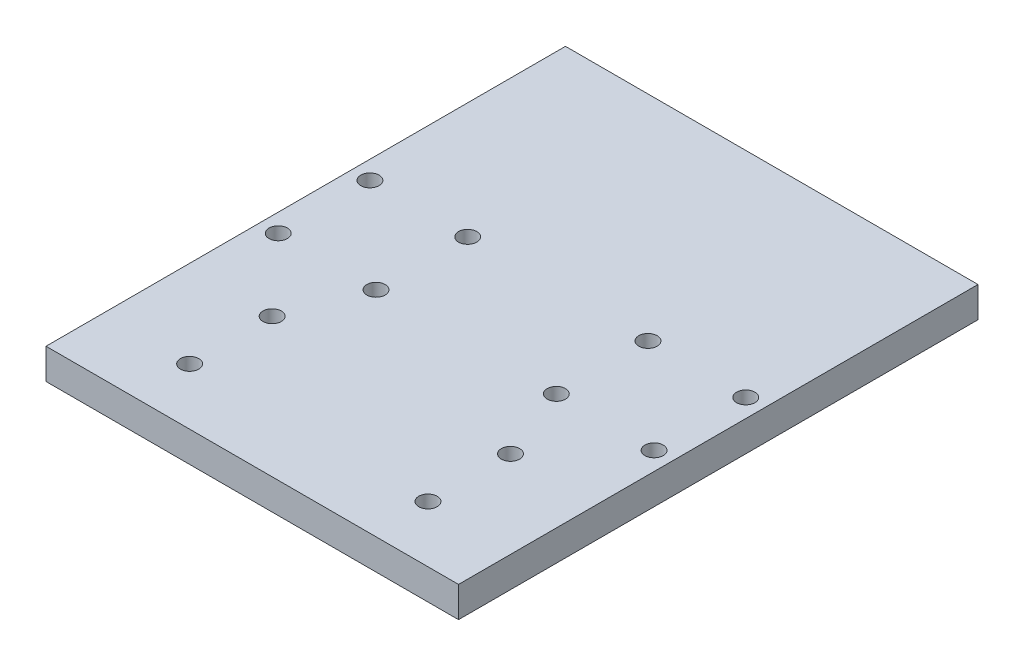
ISO-10303-21;
HEADER;
FILE_DESCRIPTION(('STEP AP214'),'2;1');
FILE_NAME('part.step','',(''),(''),'','','');
FILE_SCHEMA(('AUTOMOTIVE_DESIGN { 1 0 10303 214 1 1 1 1 }'));
ENDSEC;
DATA;
#1=APPLICATION_CONTEXT('core data for automotive mechanical design processes');
#2=APPLICATION_PROTOCOL_DEFINITION('international standard','automotive_design',2000,#1);
#3=PRODUCT_CONTEXT('',#1,'mechanical');
#4=PRODUCT('Part','Part','',(#3));
#5=PRODUCT_RELATED_PRODUCT_CATEGORY('part','',(#4));
#6=PRODUCT_DEFINITION_FORMATION('','',#4);
#7=PRODUCT_DEFINITION_CONTEXT('part definition',#1,'design');
#8=PRODUCT_DEFINITION('design','',#6,#7);
#9=PRODUCT_DEFINITION_SHAPE('','',#8);
#10=(LENGTH_UNIT() NAMED_UNIT(*) SI_UNIT(.MILLI.,.METRE.));
#11=(NAMED_UNIT(*) PLANE_ANGLE_UNIT() SI_UNIT($,.RADIAN.));
#12=(NAMED_UNIT(*) SI_UNIT($,.STERADIAN.) SOLID_ANGLE_UNIT());
#13=UNCERTAINTY_MEASURE_WITH_UNIT(LENGTH_MEASURE(1.E-05),#10,'distance_accuracy_value','');
#14=(GEOMETRIC_REPRESENTATION_CONTEXT(3) GLOBAL_UNCERTAINTY_ASSIGNED_CONTEXT((#13)) GLOBAL_UNIT_ASSIGNED_CONTEXT((#10,
#11,#12)) REPRESENTATION_CONTEXT('',''));
#15=CARTESIAN_POINT('',(0.,0.,0.));
#16=DIRECTION('',(0.,0.,1.));
#17=DIRECTION('',(1.,0.,0.));
#18=AXIS2_PLACEMENT_3D('',#15,#16,#17);
#19=CARTESIAN_POINT('',(0.,5.,0.));
#20=DIRECTION('',(0.,-1.,0.));
#21=DIRECTION('',(0.,0.,-1.));
#22=AXIS2_PLACEMENT_3D('',#19,#20,#21);
#23=PLANE('',#22);
#24=CARTESIAN_POINT('',(-19.5,5.,19.75));
#25=DIRECTION('',(0.,1.,0.));
#26=DIRECTION('',(0.,0.,1.));
#27=AXIS2_PLACEMENT_3D('',#24,#25,#26);
#28=CIRCLE('',#27,1.5);
#29=CARTESIAN_POINT('',(-19.5,5.,21.25));
#30=VERTEX_POINT('',#29);
#31=EDGE_CURVE('E445',#30,#30,#28,.T.);
#32=ORIENTED_EDGE('',*,*,#31,.F.);
#33=EDGE_LOOP('',(#32));
#34=FACE_BOUND('',#33,.T.);
#35=CARTESIAN_POINT('',(19.5,5.,33.2499999999999));
#36=DIRECTION('',(0.,1.,0.));
#37=DIRECTION('',(0.,0.,-1.));
#38=AXIS2_PLACEMENT_3D('',#35,#36,#37);
#39=CIRCLE('',#38,1.50000000000001);
#40=CARTESIAN_POINT('',(19.5,5.,31.7499999999999));
#41=VERTEX_POINT('',#40);
#42=EDGE_CURVE('E441',#41,#41,#39,.T.);
#43=ORIENTED_EDGE('',*,*,#42,.F.);
#44=EDGE_LOOP('',(#43));
#45=FACE_BOUND('',#44,.T.);
#46=CARTESIAN_POINT('',(19.5,5.,19.7499999999999));
#47=DIRECTION('',(0.,1.,0.));
#48=DIRECTION('',(0.,0.,-1.));
#49=AXIS2_PLACEMENT_3D('',#46,#47,#48);
#50=CIRCLE('',#49,1.50000000000001);
#51=CARTESIAN_POINT('',(19.5,5.,18.2499999999999));
#52=VERTEX_POINT('',#51);
#53=EDGE_CURVE('E438',#52,#52,#50,.T.);
#54=ORIENTED_EDGE('',*,*,#53,.F.);
#55=EDGE_LOOP('',(#54));
#56=FACE_BOUND('',#55,.T.);
#57=CARTESIAN_POINT('',(-19.5,5.,33.25));
#58=DIRECTION('',(0.,1.,0.));
#59=DIRECTION('',(0.,0.,1.));
#60=AXIS2_PLACEMENT_3D('',#57,#58,#59);
#61=CIRCLE('',#60,1.5);
#62=CARTESIAN_POINT('',(-19.5,5.,34.75));
#63=VERTEX_POINT('',#62);
#64=EDGE_CURVE('E114',#63,#63,#61,.T.);
#65=ORIENTED_EDGE('',*,*,#64,.F.);
#66=EDGE_LOOP('',(#65));
#67=FACE_BOUND('',#66,.T.);
#68=CARTESIAN_POINT('',(-14.75,5.,7.5));
#69=DIRECTION('',(0.,1.,0.));
#70=DIRECTION('',(0.,0.,1.));
#71=AXIS2_PLACEMENT_3D('',#68,#69,#70);
#72=CIRCLE('',#71,1.5);
#73=CARTESIAN_POINT('',(-14.75,5.,9.));
#74=VERTEX_POINT('',#73);
#75=EDGE_CURVE('E146',#74,#74,#72,.T.);
#76=ORIENTED_EDGE('',*,*,#75,.F.);
#77=EDGE_LOOP('',(#76));
#78=FACE_BOUND('',#77,.T.);
#79=CARTESIAN_POINT('',(-30.75,5.,7.5));
#80=DIRECTION('',(0.,1.,0.));
#81=DIRECTION('',(0.,0.,1.));
#82=AXIS2_PLACEMENT_3D('',#79,#80,#81);
#83=CIRCLE('',#82,1.5);
#84=CARTESIAN_POINT('',(-30.75,5.,9.));
#85=VERTEX_POINT('',#84);
#86=EDGE_CURVE('E150',#85,#85,#83,.T.);
#87=ORIENTED_EDGE('',*,*,#86,.F.);
#88=EDGE_LOOP('',(#87));
#89=FACE_BOUND('',#88,.T.);
#90=CARTESIAN_POINT('',(-14.75,5.,-7.5));
#91=DIRECTION('',(0.,1.,0.));
#92=DIRECTION('',(0.,0.,1.));
#93=AXIS2_PLACEMENT_3D('',#90,#91,#92);
#94=CIRCLE('',#93,1.5);
#95=CARTESIAN_POINT('',(-14.75,5.,-6.));
#96=VERTEX_POINT('',#95);
#97=EDGE_CURVE('E154',#96,#96,#94,.T.);
#98=ORIENTED_EDGE('',*,*,#97,.F.);
#99=EDGE_LOOP('',(#98));
#100=FACE_BOUND('',#99,.T.);
#101=CARTESIAN_POINT('',(-30.75,5.,-7.5));
#102=DIRECTION('',(0.,1.,0.));
#103=DIRECTION('',(0.,0.,1.));
#104=AXIS2_PLACEMENT_3D('',#101,#102,#103);
#105=CIRCLE('',#104,1.5);
#106=CARTESIAN_POINT('',(-30.75,5.,-6.));
#107=VERTEX_POINT('',#106);
#108=EDGE_CURVE('E158',#107,#107,#105,.T.);
#109=ORIENTED_EDGE('',*,*,#108,.F.);
#110=EDGE_LOOP('',(#109));
#111=FACE_BOUND('',#110,.T.);
#112=DIRECTION('',(1.,0.,0.));
#113=VECTOR('',#112,1.);
#114=CARTESIAN_POINT('',(-33.,5.,42.5));
#115=LINE('',#114,#113);
#116=CARTESIAN_POINT('',(-33.75,5.,42.5));
#117=VERTEX_POINT('',#116);
#118=CARTESIAN_POINT('',(33.75,5.,42.5));
#119=VERTEX_POINT('',#118);
#120=EDGE_CURVE('E11',#117,#119,#115,.T.);
#121=ORIENTED_EDGE('',*,*,#120,.T.);
#122=DIRECTION('',(0.,0.,1.));
#123=VECTOR('',#122,1.);
#124=CARTESIAN_POINT('',(33.75,5.,42.5));
#125=LINE('',#124,#123);
#126=CARTESIAN_POINT('',(33.75,5.,-42.5));
#127=VERTEX_POINT('',#126);
#128=EDGE_CURVE('E107',#127,#119,#125,.T.);
#129=ORIENTED_EDGE('',*,*,#128,.F.);
#130=DIRECTION('',(-1.,0.,0.));
#131=VECTOR('',#130,1.);
#132=CARTESIAN_POINT('',(-33.,5.,-42.5));
#133=LINE('',#132,#131);
#134=CARTESIAN_POINT('',(-33.75,5.,-42.5));
#135=VERTEX_POINT('',#134);
#136=EDGE_CURVE('E53',#127,#135,#133,.T.);
#137=ORIENTED_EDGE('',*,*,#136,.T.);
#138=DIRECTION('',(0.,0.,-1.));
#139=VECTOR('',#138,1.);
#140=CARTESIAN_POINT('',(-33.75,5.,-42.5));
#141=LINE('',#140,#139);
#142=EDGE_CURVE('E130',#117,#135,#141,.T.);
#143=ORIENTED_EDGE('',*,*,#142,.F.);
#144=EDGE_LOOP('',(#121,#129,#137,#143));
#145=FACE_BOUND('',#144,.T.);
#146=CARTESIAN_POINT('',(14.75,5.,7.5));
#147=DIRECTION('',(0.,-1.,0.));
#148=DIRECTION('',(0.,0.,-1.));
#149=AXIS2_PLACEMENT_3D('',#146,#147,#148);
#150=CIRCLE('',#149,1.5);
#151=CARTESIAN_POINT('',(14.75,5.,6.));
#152=VERTEX_POINT('',#151);
#153=EDGE_CURVE('E138',#152,#152,#150,.T.);
#154=ORIENTED_EDGE('',*,*,#153,.T.);
#155=EDGE_LOOP('',(#154));
#156=FACE_BOUND('',#155,.T.);
#157=CARTESIAN_POINT('',(30.75,5.,-7.50000000000001));
#158=DIRECTION('',(0.,-1.,0.));
#159=DIRECTION('',(0.,0.,-1.));
#160=AXIS2_PLACEMENT_3D('',#157,#158,#159);
#161=CIRCLE('',#160,1.5);
#162=CARTESIAN_POINT('',(30.75,5.,-9.00000000000001));
#163=VERTEX_POINT('',#162);
#164=EDGE_CURVE('E137',#163,#163,#161,.T.);
#165=ORIENTED_EDGE('',*,*,#164,.T.);
#166=EDGE_LOOP('',(#165));
#167=FACE_BOUND('',#166,.T.);
#168=CARTESIAN_POINT('',(30.75,5.,7.49999999999999));
#169=DIRECTION('',(0.,-1.,0.));
#170=DIRECTION('',(0.,0.,-1.));
#171=AXIS2_PLACEMENT_3D('',#168,#169,#170);
#172=CIRCLE('',#171,1.5);
#173=CARTESIAN_POINT('',(30.75,5.,5.99999999999999));
#174=VERTEX_POINT('',#173);
#175=EDGE_CURVE('E133',#174,#174,#172,.T.);
#176=ORIENTED_EDGE('',*,*,#175,.T.);
#177=EDGE_LOOP('',(#176));
#178=FACE_BOUND('',#177,.T.);
#179=CARTESIAN_POINT('',(14.75,5.,-7.5));
#180=DIRECTION('',(0.,-1.,0.));
#181=DIRECTION('',(0.,0.,-1.));
#182=AXIS2_PLACEMENT_3D('',#179,#180,#181);
#183=CIRCLE('',#182,1.5);
#184=CARTESIAN_POINT('',(14.75,5.,-9.00000000000001));
#185=VERTEX_POINT('',#184);
#186=EDGE_CURVE('E142',#185,#185,#183,.T.);
#187=ORIENTED_EDGE('',*,*,#186,.T.);
#188=EDGE_LOOP('',(#187));
#189=FACE_BOUND('',#188,.T.);
#190=ADVANCED_FACE('F43',(#34,#45,#56,#67,#78,#89,#100,#111,#145,#156,#167,#178,#189),#23,.F.);
#191=CARTESIAN_POINT('',(0.,0.,0.));
#192=DIRECTION('',(0.,-1.,0.));
#193=DIRECTION('',(0.,0.,-1.));
#194=AXIS2_PLACEMENT_3D('',#191,#192,#193);
#195=PLANE('',#194);
#196=CARTESIAN_POINT('',(-19.5,0.,19.75));
#197=DIRECTION('',(0.,-1.,0.));
#198=DIRECTION('',(0.,0.,-1.));
#199=AXIS2_PLACEMENT_3D('',#196,#197,#198);
#200=CIRCLE('',#199,1.5);
#201=CARTESIAN_POINT('',(-19.5,0.,18.25));
#202=VERTEX_POINT('',#201);
#203=EDGE_CURVE('E47',#202,#202,#200,.T.);
#204=ORIENTED_EDGE('',*,*,#203,.F.);
#205=EDGE_LOOP('',(#204));
#206=FACE_BOUND('',#205,.T.);
#207=CARTESIAN_POINT('',(19.5,0.,33.2499999999999));
#208=DIRECTION('',(0.,-1.,0.));
#209=DIRECTION('',(0.,0.,-1.));
#210=AXIS2_PLACEMENT_3D('',#207,#208,#209);
#211=CIRCLE('',#210,1.50000000000001);
#212=CARTESIAN_POINT('',(19.5,0.,31.7499999999999));
#213=VERTEX_POINT('',#212);
#214=EDGE_CURVE('E112',#213,#213,#211,.T.);
#215=ORIENTED_EDGE('',*,*,#214,.F.);
#216=EDGE_LOOP('',(#215));
#217=FACE_BOUND('',#216,.T.);
#218=CARTESIAN_POINT('',(19.5,0.,19.7499999999999));
#219=DIRECTION('',(0.,-1.,0.));
#220=DIRECTION('',(0.,0.,-1.));
#221=AXIS2_PLACEMENT_3D('',#218,#219,#220);
#222=CIRCLE('',#221,1.50000000000001);
#223=CARTESIAN_POINT('',(19.5,0.,18.2499999999999));
#224=VERTEX_POINT('',#223);
#225=EDGE_CURVE('E205',#224,#224,#222,.T.);
#226=ORIENTED_EDGE('',*,*,#225,.F.);
#227=EDGE_LOOP('',(#226));
#228=FACE_BOUND('',#227,.T.);
#229=CARTESIAN_POINT('',(-19.5,0.,33.25));
#230=DIRECTION('',(0.,-1.,0.));
#231=DIRECTION('',(0.,0.,-1.));
#232=AXIS2_PLACEMENT_3D('',#229,#230,#231);
#233=CIRCLE('',#232,1.5);
#234=CARTESIAN_POINT('',(-19.5,0.,31.75));
#235=VERTEX_POINT('',#234);
#236=EDGE_CURVE('E201',#235,#235,#233,.T.);
#237=ORIENTED_EDGE('',*,*,#236,.F.);
#238=EDGE_LOOP('',(#237));
#239=FACE_BOUND('',#238,.T.);
#240=CARTESIAN_POINT('',(30.75,0.,7.49999999999999));
#241=DIRECTION('',(0.,-1.,0.));
#242=DIRECTION('',(0.,0.,-1.));
#243=AXIS2_PLACEMENT_3D('',#240,#241,#242);
#244=CIRCLE('',#243,1.5);
#245=CARTESIAN_POINT('',(30.75,0.,5.99999999999999));
#246=VERTEX_POINT('',#245);
#247=EDGE_CURVE('E182',#246,#246,#244,.F.);
#248=ORIENTED_EDGE('',*,*,#247,.T.);
#249=EDGE_LOOP('',(#248));
#250=FACE_BOUND('',#249,.T.);
#251=CARTESIAN_POINT('',(14.75,0.,7.5));
#252=DIRECTION('',(0.,-1.,0.));
#253=DIRECTION('',(0.,0.,-1.));
#254=AXIS2_PLACEMENT_3D('',#251,#252,#253);
#255=CIRCLE('',#254,1.5);
#256=CARTESIAN_POINT('',(14.75,0.,6.));
#257=VERTEX_POINT('',#256);
#258=EDGE_CURVE('E174',#257,#257,#255,.F.);
#259=ORIENTED_EDGE('',*,*,#258,.T.);
#260=EDGE_LOOP('',(#259));
#261=FACE_BOUND('',#260,.T.);
#262=CARTESIAN_POINT('',(-30.75,0.,-7.5));
#263=DIRECTION('',(0.,-1.,0.));
#264=DIRECTION('',(0.,0.,-1.));
#265=AXIS2_PLACEMENT_3D('',#262,#263,#264);
#266=CIRCLE('',#265,1.5);
#267=CARTESIAN_POINT('',(-30.75,0.,-9.));
#268=VERTEX_POINT('',#267);
#269=EDGE_CURVE('E165',#268,#268,#266,.T.);
#270=ORIENTED_EDGE('',*,*,#269,.F.);
#271=EDGE_LOOP('',(#270));
#272=FACE_BOUND('',#271,.T.);
#273=DIRECTION('',(-1.,0.,0.));
#274=VECTOR('',#273,1.);
#275=CARTESIAN_POINT('',(-33.,0.,-42.5));
#276=LINE('',#275,#274);
#277=CARTESIAN_POINT('',(33.75,0.,-42.5));
#278=VERTEX_POINT('',#277);
#279=CARTESIAN_POINT('',(-33.75,0.,-42.5));
#280=VERTEX_POINT('',#279);
#281=EDGE_CURVE('E93',#278,#280,#276,.T.);
#282=ORIENTED_EDGE('',*,*,#281,.F.);
#283=DIRECTION('',(0.,0.,-1.));
#284=VECTOR('',#283,1.);
#285=CARTESIAN_POINT('',(33.75,0.,42.5));
#286=LINE('',#285,#284);
#287=CARTESIAN_POINT('',(33.75,0.,42.5));
#288=VERTEX_POINT('',#287);
#289=EDGE_CURVE('E96',#288,#278,#286,.T.);
#290=ORIENTED_EDGE('',*,*,#289,.F.);
#291=DIRECTION('',(1.,0.,0.));
#292=VECTOR('',#291,1.);
#293=CARTESIAN_POINT('',(-33.,0.,42.5));
#294=LINE('',#293,#292);
#295=CARTESIAN_POINT('',(-33.75,0.,42.5));
#296=VERTEX_POINT('',#295);
#297=EDGE_CURVE('E83',#296,#288,#294,.T.);
#298=ORIENTED_EDGE('',*,*,#297,.F.);
#299=DIRECTION('',(0.,0.,1.));
#300=VECTOR('',#299,1.);
#301=CARTESIAN_POINT('',(-33.75,0.,-42.5));
#302=LINE('',#301,#300);
#303=EDGE_CURVE('E125',#280,#296,#302,.T.);
#304=ORIENTED_EDGE('',*,*,#303,.F.);
#305=EDGE_LOOP('',(#282,#290,#298,#304));
#306=FACE_BOUND('',#305,.T.);
#307=CARTESIAN_POINT('',(30.75,0.,-7.50000000000001));
#308=DIRECTION('',(0.,-1.,0.));
#309=DIRECTION('',(0.,0.,-1.));
#310=AXIS2_PLACEMENT_3D('',#307,#308,#309);
#311=CIRCLE('',#310,1.5);
#312=CARTESIAN_POINT('',(30.75,0.,-9.00000000000001));
#313=VERTEX_POINT('',#312);
#314=EDGE_CURVE('E178',#313,#313,#311,.F.);
#315=ORIENTED_EDGE('',*,*,#314,.T.);
#316=EDGE_LOOP('',(#315));
#317=FACE_BOUND('',#316,.T.);
#318=CARTESIAN_POINT('',(-14.75,0.,-7.5));
#319=DIRECTION('',(0.,-1.,0.));
#320=DIRECTION('',(0.,0.,-1.));
#321=AXIS2_PLACEMENT_3D('',#318,#319,#320);
#322=CIRCLE('',#321,1.5);
#323=CARTESIAN_POINT('',(-14.75,0.,-9.));
#324=VERTEX_POINT('',#323);
#325=EDGE_CURVE('E186',#324,#324,#322,.T.);
#326=ORIENTED_EDGE('',*,*,#325,.F.);
#327=EDGE_LOOP('',(#326));
#328=FACE_BOUND('',#327,.T.);
#329=CARTESIAN_POINT('',(-30.75,0.,7.5));
#330=DIRECTION('',(0.,-1.,0.));
#331=DIRECTION('',(0.,0.,-1.));
#332=AXIS2_PLACEMENT_3D('',#329,#330,#331);
#333=CIRCLE('',#332,1.5);
#334=CARTESIAN_POINT('',(-30.75,0.,6.));
#335=VERTEX_POINT('',#334);
#336=EDGE_CURVE('E190',#335,#335,#333,.T.);
#337=ORIENTED_EDGE('',*,*,#336,.F.);
#338=EDGE_LOOP('',(#337));
#339=FACE_BOUND('',#338,.T.);
#340=CARTESIAN_POINT('',(-14.75,0.,7.5));
#341=DIRECTION('',(0.,-1.,0.));
#342=DIRECTION('',(0.,0.,-1.));
#343=AXIS2_PLACEMENT_3D('',#340,#341,#342);
#344=CIRCLE('',#343,1.5);
#345=CARTESIAN_POINT('',(-14.75,0.,6.));
#346=VERTEX_POINT('',#345);
#347=EDGE_CURVE('E194',#346,#346,#344,.T.);
#348=ORIENTED_EDGE('',*,*,#347,.F.);
#349=EDGE_LOOP('',(#348));
#350=FACE_BOUND('',#349,.T.);
#351=CARTESIAN_POINT('',(14.75,0.,-7.5));
#352=DIRECTION('',(0.,-1.,0.));
#353=DIRECTION('',(0.,0.,-1.));
#354=AXIS2_PLACEMENT_3D('',#351,#352,#353);
#355=CIRCLE('',#354,1.5);
#356=CARTESIAN_POINT('',(14.75,0.,-9.00000000000001));
#357=VERTEX_POINT('',#356);
#358=EDGE_CURVE('E169',#357,#357,#355,.F.);
#359=ORIENTED_EDGE('',*,*,#358,.T.);
#360=EDGE_LOOP('',(#359));
#361=FACE_BOUND('',#360,.T.);
#362=ADVANCED_FACE('F97',(#206,#217,#228,#239,#250,#261,#272,#306,#317,#328,#339,#350,#361),
#195,.T.);
#363=CARTESIAN_POINT('',(-33.,5.,-42.5));
#364=DIRECTION('',(0.,0.,1.));
#365=DIRECTION('',(1.,0.,0.));
#366=AXIS2_PLACEMENT_3D('',#363,#364,#365);
#367=PLANE('',#366);
#368=ORIENTED_EDGE('',*,*,#281,.T.);
#369=DIRECTION('',(0.,-1.,0.));
#370=VECTOR('',#369,1.);
#371=CARTESIAN_POINT('',(-33.75,5.,-42.5));
#372=LINE('',#371,#370);
#373=EDGE_CURVE('E121',#135,#280,#372,.T.);
#374=ORIENTED_EDGE('',*,*,#373,.F.);
#375=ORIENTED_EDGE('',*,*,#136,.F.);
#376=DIRECTION('',(0.,1.,0.));
#377=VECTOR('',#376,1.);
#378=CARTESIAN_POINT('',(33.75,5.,-42.5));
#379=LINE('',#378,#377);
#380=EDGE_CURVE('E103',#278,#127,#379,.T.);
#381=ORIENTED_EDGE('',*,*,#380,.F.);
#382=EDGE_LOOP('',(#368,#374,#375,#381));
#383=FACE_BOUND('',#382,.T.);
#384=ADVANCED_FACE('F45',(#383),#367,.F.);
#385=CARTESIAN_POINT('',(-33.,5.,42.5));
#386=DIRECTION('',(0.,0.,-1.));
#387=DIRECTION('',(-1.,0.,0.));
#388=AXIS2_PLACEMENT_3D('',#385,#386,#387);
#389=PLANE('',#388);
#390=ORIENTED_EDGE('',*,*,#297,.T.);
#391=DIRECTION('',(0.,-1.,0.));
#392=VECTOR('',#391,1.);
#393=CARTESIAN_POINT('',(33.75,5.,42.5));
#394=LINE('',#393,#392);
#395=EDGE_CURVE('E87',#119,#288,#394,.T.);
#396=ORIENTED_EDGE('',*,*,#395,.F.);
#397=ORIENTED_EDGE('',*,*,#120,.F.);
#398=DIRECTION('',(0.,1.,0.));
#399=VECTOR('',#398,1.);
#400=CARTESIAN_POINT('',(-33.75,5.,42.5));
#401=LINE('',#400,#399);
#402=EDGE_CURVE('E88',#296,#117,#401,.T.);
#403=ORIENTED_EDGE('',*,*,#402,.F.);
#404=EDGE_LOOP('',(#390,#396,#397,#403));
#405=FACE_BOUND('',#404,.T.);
#406=ADVANCED_FACE('F85',(#405),#389,.F.);
#407=CARTESIAN_POINT('',(-30.75,-5.,-7.5));
#408=DIRECTION('',(0.,1.,0.));
#409=DIRECTION('',(0.,0.,1.));
#410=AXIS2_PLACEMENT_3D('',#407,#408,#409);
#411=CYLINDRICAL_SURFACE('',#410,1.5);
#412=ORIENTED_EDGE('',*,*,#269,.T.);
#413=EDGE_LOOP('',(#412));
#414=FACE_BOUND('',#413,.T.);
#415=ORIENTED_EDGE('',*,*,#108,.T.);
#416=EDGE_LOOP('',(#415));
#417=FACE_BOUND('',#416,.T.);
#418=ADVANCED_FACE('F229',(#414,#417),#411,.F.);
#419=CARTESIAN_POINT('',(14.75,-5.,7.5));
#420=DIRECTION('',(0.,1.,0.));
#421=DIRECTION('',(0.,0.,1.));
#422=AXIS2_PLACEMENT_3D('',#419,#420,#421);
#423=CYLINDRICAL_SURFACE('',#422,1.5);
#424=ORIENTED_EDGE('',*,*,#258,.F.);
#425=EDGE_LOOP('',(#424));
#426=FACE_BOUND('',#425,.T.);
#427=ORIENTED_EDGE('',*,*,#153,.F.);
#428=EDGE_LOOP('',(#427));
#429=FACE_BOUND('',#428,.T.);
#430=ADVANCED_FACE('F232',(#426,#429),#423,.F.);
#431=CARTESIAN_POINT('',(30.75,-5.,-7.50000000000001));
#432=DIRECTION('',(0.,1.,0.));
#433=DIRECTION('',(0.,0.,1.));
#434=AXIS2_PLACEMENT_3D('',#431,#432,#433);
#435=CYLINDRICAL_SURFACE('',#434,1.5);
#436=ORIENTED_EDGE('',*,*,#314,.F.);
#437=EDGE_LOOP('',(#436));
#438=FACE_BOUND('',#437,.T.);
#439=ORIENTED_EDGE('',*,*,#164,.F.);
#440=EDGE_LOOP('',(#439));
#441=FACE_BOUND('',#440,.T.);
#442=ADVANCED_FACE('F374',(#438,#441),#435,.F.);
#443=CARTESIAN_POINT('',(30.75,-5.,7.49999999999999));
#444=DIRECTION('',(0.,1.,0.));
#445=DIRECTION('',(0.,0.,1.));
#446=AXIS2_PLACEMENT_3D('',#443,#444,#445);
#447=CYLINDRICAL_SURFACE('',#446,1.5);
#448=ORIENTED_EDGE('',*,*,#247,.F.);
#449=EDGE_LOOP('',(#448));
#450=FACE_BOUND('',#449,.T.);
#451=ORIENTED_EDGE('',*,*,#175,.F.);
#452=EDGE_LOOP('',(#451));
#453=FACE_BOUND('',#452,.T.);
#454=ADVANCED_FACE('F269',(#450,#453),#447,.F.);
#455=CARTESIAN_POINT('',(-14.75,-5.,-7.5));
#456=DIRECTION('',(0.,1.,0.));
#457=DIRECTION('',(0.,0.,1.));
#458=AXIS2_PLACEMENT_3D('',#455,#456,#457);
#459=CYLINDRICAL_SURFACE('',#458,1.5);
#460=ORIENTED_EDGE('',*,*,#325,.T.);
#461=EDGE_LOOP('',(#460));
#462=FACE_BOUND('',#461,.T.);
#463=ORIENTED_EDGE('',*,*,#97,.T.);
#464=EDGE_LOOP('',(#463));
#465=FACE_BOUND('',#464,.T.);
#466=ADVANCED_FACE('F266',(#462,#465),#459,.F.);
#467=CARTESIAN_POINT('',(-30.75,-5.,7.5));
#468=DIRECTION('',(0.,1.,0.));
#469=DIRECTION('',(0.,0.,1.));
#470=AXIS2_PLACEMENT_3D('',#467,#468,#469);
#471=CYLINDRICAL_SURFACE('',#470,1.5);
#472=ORIENTED_EDGE('',*,*,#336,.T.);
#473=EDGE_LOOP('',(#472));
#474=FACE_BOUND('',#473,.T.);
#475=ORIENTED_EDGE('',*,*,#86,.T.);
#476=EDGE_LOOP('',(#475));
#477=FACE_BOUND('',#476,.T.);
#478=ADVANCED_FACE('F260',(#474,#477),#471,.F.);
#479=CARTESIAN_POINT('',(-14.75,-5.,7.5));
#480=DIRECTION('',(0.,1.,0.));
#481=DIRECTION('',(0.,0.,1.));
#482=AXIS2_PLACEMENT_3D('',#479,#480,#481);
#483=CYLINDRICAL_SURFACE('',#482,1.5);
#484=ORIENTED_EDGE('',*,*,#347,.T.);
#485=EDGE_LOOP('',(#484));
#486=FACE_BOUND('',#485,.T.);
#487=ORIENTED_EDGE('',*,*,#75,.T.);
#488=EDGE_LOOP('',(#487));
#489=FACE_BOUND('',#488,.T.);
#490=ADVANCED_FACE('F251',(#486,#489),#483,.F.);
#491=CARTESIAN_POINT('',(14.75,-5.,-7.5));
#492=DIRECTION('',(0.,1.,0.));
#493=DIRECTION('',(0.,0.,1.));
#494=AXIS2_PLACEMENT_3D('',#491,#492,#493);
#495=CYLINDRICAL_SURFACE('',#494,1.5);
#496=ORIENTED_EDGE('',*,*,#358,.F.);
#497=EDGE_LOOP('',(#496));
#498=FACE_BOUND('',#497,.T.);
#499=ORIENTED_EDGE('',*,*,#186,.F.);
#500=EDGE_LOOP('',(#499));
#501=FACE_BOUND('',#500,.T.);
#502=ADVANCED_FACE('F248',(#498,#501),#495,.F.);
#503=CARTESIAN_POINT('',(-33.75,0.,0.));
#504=DIRECTION('',(-1.,0.,0.));
#505=DIRECTION('',(0.,0.,1.));
#506=AXIS2_PLACEMENT_3D('',#503,#504,#505);
#507=PLANE('',#506);
#508=ORIENTED_EDGE('',*,*,#373,.T.);
#509=ORIENTED_EDGE('',*,*,#303,.T.);
#510=ORIENTED_EDGE('',*,*,#402,.T.);
#511=ORIENTED_EDGE('',*,*,#142,.T.);
#512=EDGE_LOOP('',(#508,#509,#510,#511));
#513=FACE_BOUND('',#512,.T.);
#514=ADVANCED_FACE('F250',(#513),#507,.T.);
#515=CARTESIAN_POINT('',(33.75,0.,0.));
#516=DIRECTION('',(1.,0.,0.));
#517=DIRECTION('',(0.,0.,-1.));
#518=AXIS2_PLACEMENT_3D('',#515,#516,#517);
#519=PLANE('',#518);
#520=ORIENTED_EDGE('',*,*,#395,.T.);
#521=ORIENTED_EDGE('',*,*,#289,.T.);
#522=ORIENTED_EDGE('',*,*,#380,.T.);
#523=ORIENTED_EDGE('',*,*,#128,.T.);
#524=EDGE_LOOP('',(#520,#521,#522,#523));
#525=FACE_BOUND('',#524,.T.);
#526=ADVANCED_FACE('F106',(#525),#519,.T.);
#527=CARTESIAN_POINT('',(-19.5,-5.,33.25));
#528=DIRECTION('',(0.,1.,0.));
#529=DIRECTION('',(0.,0.,1.));
#530=AXIS2_PLACEMENT_3D('',#527,#528,#529);
#531=CYLINDRICAL_SURFACE('',#530,1.5);
#532=ORIENTED_EDGE('',*,*,#236,.T.);
#533=EDGE_LOOP('',(#532));
#534=FACE_BOUND('',#533,.T.);
#535=ORIENTED_EDGE('',*,*,#64,.T.);
#536=EDGE_LOOP('',(#535));
#537=FACE_BOUND('',#536,.T.);
#538=ADVANCED_FACE('F301',(#534,#537),#531,.F.);
#539=CARTESIAN_POINT('',(19.5,-5.,19.7499999999999));
#540=DIRECTION('',(0.,1.,0.));
#541=DIRECTION('',(0.,0.,1.));
#542=AXIS2_PLACEMENT_3D('',#539,#540,#541);
#543=CYLINDRICAL_SURFACE('',#542,1.50000000000001);
#544=ORIENTED_EDGE('',*,*,#225,.T.);
#545=EDGE_LOOP('',(#544));
#546=FACE_BOUND('',#545,.T.);
#547=ORIENTED_EDGE('',*,*,#53,.T.);
#548=EDGE_LOOP('',(#547));
#549=FACE_BOUND('',#548,.T.);
#550=ADVANCED_FACE('F423',(#546,#549),#543,.F.);
#551=CARTESIAN_POINT('',(19.5,-5.,33.2499999999999));
#552=DIRECTION('',(0.,1.,0.));
#553=DIRECTION('',(0.,0.,1.));
#554=AXIS2_PLACEMENT_3D('',#551,#552,#553);
#555=CYLINDRICAL_SURFACE('',#554,1.50000000000001);
#556=ORIENTED_EDGE('',*,*,#214,.T.);
#557=EDGE_LOOP('',(#556));
#558=FACE_BOUND('',#557,.T.);
#559=ORIENTED_EDGE('',*,*,#42,.T.);
#560=EDGE_LOOP('',(#559));
#561=FACE_BOUND('',#560,.T.);
#562=ADVANCED_FACE('F212',(#558,#561),#555,.F.);
#563=CARTESIAN_POINT('',(-19.5,-5.,19.75));
#564=DIRECTION('',(0.,1.,0.));
#565=DIRECTION('',(0.,0.,1.));
#566=AXIS2_PLACEMENT_3D('',#563,#564,#565);
#567=CYLINDRICAL_SURFACE('',#566,1.5);
#568=ORIENTED_EDGE('',*,*,#203,.T.);
#569=EDGE_LOOP('',(#568));
#570=FACE_BOUND('',#569,.T.);
#571=ORIENTED_EDGE('',*,*,#31,.T.);
#572=EDGE_LOOP('',(#571));
#573=FACE_BOUND('',#572,.T.);
#574=ADVANCED_FACE('F427',(#570,#573),#567,.F.);
#575=CLOSED_SHELL('',(#190,#362,#384,#406,#418,#430,#442,#454,#466,#478,#490,#502,#514,#526,
#538,#550,#562,#574));
#576=MANIFOLD_SOLID_BREP('B2',#575);
#577=ADVANCED_BREP_SHAPE_REPRESENTATION('',(#18,#576),#14);
#578=SHAPE_DEFINITION_REPRESENTATION(#9,#577);
ENDSEC;
END-ISO-10303-21;
